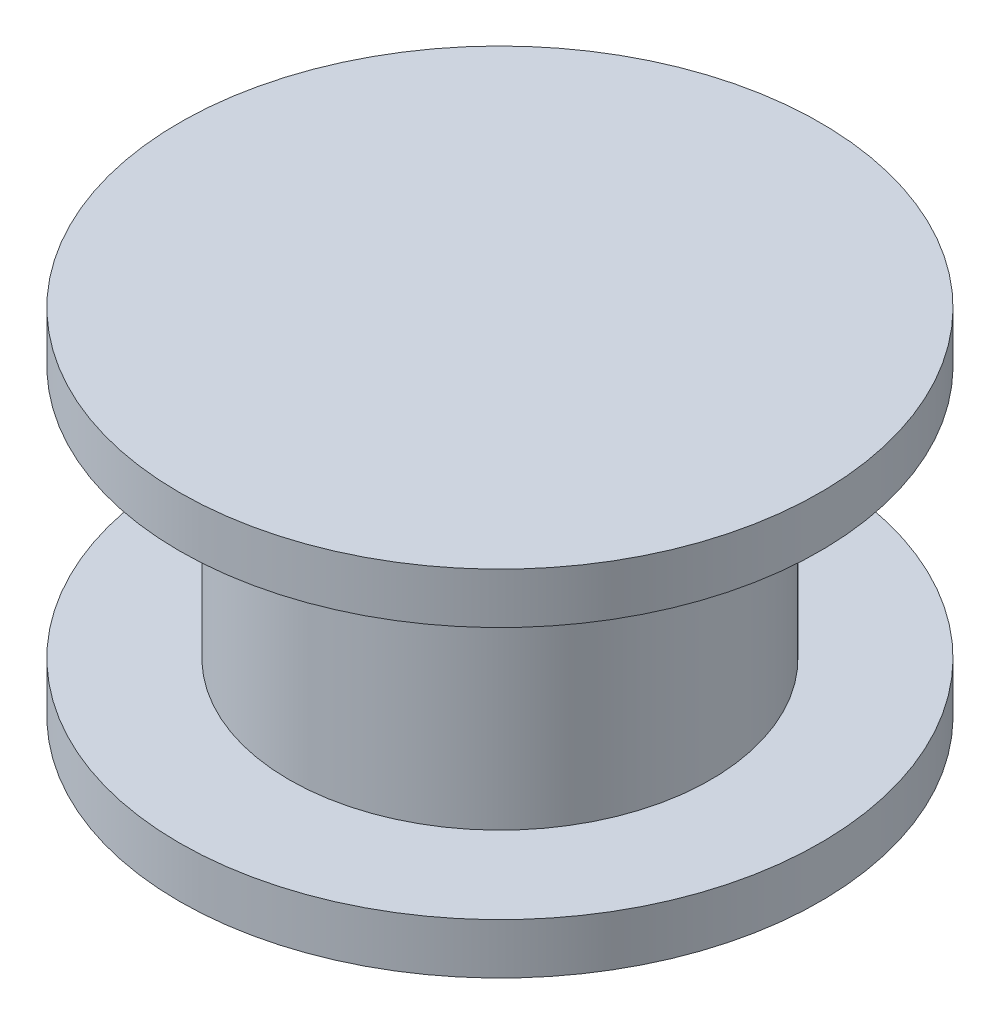
ISO-10303-21;
HEADER;
FILE_DESCRIPTION(('STEP AP214'),'2;1');
FILE_NAME('part.step','',(''),(''),'','','');
FILE_SCHEMA(('AUTOMOTIVE_DESIGN { 1 0 10303 214 1 1 1 1 }'));
ENDSEC;
DATA;
#1=APPLICATION_CONTEXT('core data for automotive mechanical design processes');
#2=APPLICATION_PROTOCOL_DEFINITION('international standard','automotive_design',2000,#1);
#3=PRODUCT_CONTEXT('',#1,'mechanical');
#4=PRODUCT('Part','Part','',(#3));
#5=PRODUCT_RELATED_PRODUCT_CATEGORY('part','',(#4));
#6=PRODUCT_DEFINITION_FORMATION('','',#4);
#7=PRODUCT_DEFINITION_CONTEXT('part definition',#1,'design');
#8=PRODUCT_DEFINITION('design','',#6,#7);
#9=PRODUCT_DEFINITION_SHAPE('','',#8);
#10=(LENGTH_UNIT() NAMED_UNIT(*) SI_UNIT(.MILLI.,.METRE.));
#11=(NAMED_UNIT(*) PLANE_ANGLE_UNIT() SI_UNIT($,.RADIAN.));
#12=(NAMED_UNIT(*) SI_UNIT($,.STERADIAN.) SOLID_ANGLE_UNIT());
#13=UNCERTAINTY_MEASURE_WITH_UNIT(LENGTH_MEASURE(1.E-05),#10,'distance_accuracy_value','');
#14=(GEOMETRIC_REPRESENTATION_CONTEXT(3) GLOBAL_UNCERTAINTY_ASSIGNED_CONTEXT((#13)) GLOBAL_UNIT_ASSIGNED_CONTEXT((#10,
#11,#12)) REPRESENTATION_CONTEXT('',''));
#15=CARTESIAN_POINT('',(0.,0.,0.));
#16=DIRECTION('',(0.,0.,1.));
#17=DIRECTION('',(1.,0.,0.));
#18=AXIS2_PLACEMENT_3D('',#15,#16,#17);
#19=CARTESIAN_POINT('',(0.,1.5,0.));
#20=DIRECTION('',(0.,-1.,0.));
#21=DIRECTION('',(0.,0.,-1.));
#22=AXIS2_PLACEMENT_3D('',#19,#20,#21);
#23=CYLINDRICAL_SURFACE('',#22,9.5);
#24=CARTESIAN_POINT('',(0.,1.5,0.));
#25=DIRECTION('',(0.,1.,0.));
#26=DIRECTION('',(0.,0.,1.));
#27=AXIS2_PLACEMENT_3D('',#24,#25,#26);
#28=CIRCLE('',#27,9.5);
#29=CARTESIAN_POINT('',(0.,1.5,9.5));
#30=VERTEX_POINT('',#29);
#31=EDGE_CURVE('E39',#30,#30,#28,.T.);
#32=ORIENTED_EDGE('',*,*,#31,.F.);
#33=EDGE_LOOP('',(#32));
#34=FACE_BOUND('',#33,.T.);
#35=CARTESIAN_POINT('',(0.,0.,0.));
#36=DIRECTION('',(0.,1.,0.));
#37=DIRECTION('',(0.,0.,1.));
#38=AXIS2_PLACEMENT_3D('',#35,#36,#37);
#39=CIRCLE('',#38,9.5);
#40=CARTESIAN_POINT('',(0.,0.,9.5));
#41=VERTEX_POINT('',#40);
#42=EDGE_CURVE('E35',#41,#41,#39,.T.);
#43=ORIENTED_EDGE('',*,*,#42,.T.);
#44=EDGE_LOOP('',(#43));
#45=FACE_BOUND('',#44,.T.);
#46=ADVANCED_FACE('F32',(#34,#45),#23,.T.);
#47=CARTESIAN_POINT('',(0.,1.5,0.));
#48=DIRECTION('',(0.,1.,0.));
#49=DIRECTION('',(0.,0.,1.));
#50=AXIS2_PLACEMENT_3D('',#47,#48,#49);
#51=PLANE('',#50);
#52=CARTESIAN_POINT('',(0.,1.5,0.));
#53=DIRECTION('',(0.,1.,0.));
#54=DIRECTION('',(0.,0.,1.));
#55=AXIS2_PLACEMENT_3D('',#52,#53,#54);
#56=CIRCLE('',#55,6.25);
#57=CARTESIAN_POINT('',(0.,1.5,6.25));
#58=VERTEX_POINT('',#57);
#59=EDGE_CURVE('E10',#58,#58,#56,.T.);
#60=ORIENTED_EDGE('',*,*,#59,.F.);
#61=EDGE_LOOP('',(#60));
#62=FACE_BOUND('',#61,.T.);
#63=ORIENTED_EDGE('',*,*,#31,.T.);
#64=EDGE_LOOP('',(#63));
#65=FACE_BOUND('',#64,.T.);
#66=ADVANCED_FACE('F73',(#62,#65),#51,.T.);
#67=CARTESIAN_POINT('',(0.,0.,0.));
#68=DIRECTION('',(0.,1.,0.));
#69=DIRECTION('',(0.,0.,1.));
#70=AXIS2_PLACEMENT_3D('',#67,#68,#69);
#71=PLANE('',#70);
#72=ORIENTED_EDGE('',*,*,#42,.F.);
#73=EDGE_LOOP('',(#72));
#74=FACE_BOUND('',#73,.T.);
#75=ADVANCED_FACE('F78',(#74),#71,.F.);
#76=CARTESIAN_POINT('',(0.,9.,0.));
#77=DIRECTION('',(0.,-1.,0.));
#78=DIRECTION('',(0.,0.,-1.));
#79=AXIS2_PLACEMENT_3D('',#76,#77,#78);
#80=CYLINDRICAL_SURFACE('',#79,6.25);
#81=CARTESIAN_POINT('',(0.,9.,0.));
#82=DIRECTION('',(0.,1.,0.));
#83=DIRECTION('',(0.,0.,1.));
#84=AXIS2_PLACEMENT_3D('',#81,#82,#83);
#85=CIRCLE('',#84,6.25);
#86=CARTESIAN_POINT('',(0.,9.,6.25));
#87=VERTEX_POINT('',#86);
#88=EDGE_CURVE('E45',#87,#87,#85,.T.);
#89=ORIENTED_EDGE('',*,*,#88,.F.);
#90=EDGE_LOOP('',(#89));
#91=FACE_BOUND('',#90,.T.);
#92=ORIENTED_EDGE('',*,*,#59,.T.);
#93=EDGE_LOOP('',(#92));
#94=FACE_BOUND('',#93,.T.);
#95=ADVANCED_FACE('F60',(#91,#94),#80,.T.);
#96=CARTESIAN_POINT('',(0.,10.5,0.));
#97=DIRECTION('',(0.,-1.,0.));
#98=DIRECTION('',(0.,0.,-1.));
#99=AXIS2_PLACEMENT_3D('',#96,#97,#98);
#100=CYLINDRICAL_SURFACE('',#99,9.5);
#101=CARTESIAN_POINT('',(0.,10.5,0.));
#102=DIRECTION('',(0.,1.,0.));
#103=DIRECTION('',(0.,0.,1.));
#104=AXIS2_PLACEMENT_3D('',#101,#102,#103);
#105=CIRCLE('',#104,9.5);
#106=CARTESIAN_POINT('',(0.,10.5,9.5));
#107=VERTEX_POINT('',#106);
#108=EDGE_CURVE('E48',#107,#107,#105,.T.);
#109=ORIENTED_EDGE('',*,*,#108,.F.);
#110=EDGE_LOOP('',(#109));
#111=FACE_BOUND('',#110,.T.);
#112=CARTESIAN_POINT('',(0.,9.,0.));
#113=DIRECTION('',(0.,1.,0.));
#114=DIRECTION('',(0.,0.,1.));
#115=AXIS2_PLACEMENT_3D('',#112,#113,#114);
#116=CIRCLE('',#115,9.5);
#117=CARTESIAN_POINT('',(0.,9.,9.5));
#118=VERTEX_POINT('',#117);
#119=EDGE_CURVE('E49',#118,#118,#116,.T.);
#120=ORIENTED_EDGE('',*,*,#119,.T.);
#121=EDGE_LOOP('',(#120));
#122=FACE_BOUND('',#121,.T.);
#123=ADVANCED_FACE('F57',(#111,#122),#100,.T.);
#124=CARTESIAN_POINT('',(0.,10.5,0.));
#125=DIRECTION('',(0.,1.,0.));
#126=DIRECTION('',(0.,0.,1.));
#127=AXIS2_PLACEMENT_3D('',#124,#125,#126);
#128=PLANE('',#127);
#129=ORIENTED_EDGE('',*,*,#108,.T.);
#130=EDGE_LOOP('',(#129));
#131=FACE_BOUND('',#130,.T.);
#132=ADVANCED_FACE('F55',(#131),#128,.T.);
#133=CARTESIAN_POINT('',(0.,9.,0.));
#134=DIRECTION('',(0.,1.,0.));
#135=DIRECTION('',(0.,0.,1.));
#136=AXIS2_PLACEMENT_3D('',#133,#134,#135);
#137=PLANE('',#136);
#138=ORIENTED_EDGE('',*,*,#88,.T.);
#139=EDGE_LOOP('',(#138));
#140=FACE_BOUND('',#139,.T.);
#141=ORIENTED_EDGE('',*,*,#119,.F.);
#142=EDGE_LOOP('',(#141));
#143=FACE_BOUND('',#142,.T.);
#144=ADVANCED_FACE('F64',(#140,#143),#137,.F.);
#145=CLOSED_SHELL('',(#46,#66,#75,#95,#123,#132,#144));
#146=MANIFOLD_SOLID_BREP('B2',#145);
#147=ADVANCED_BREP_SHAPE_REPRESENTATION('',(#18,#146),#14);
#148=SHAPE_DEFINITION_REPRESENTATION(#9,#147);
ENDSEC;
END-ISO-10303-21;
